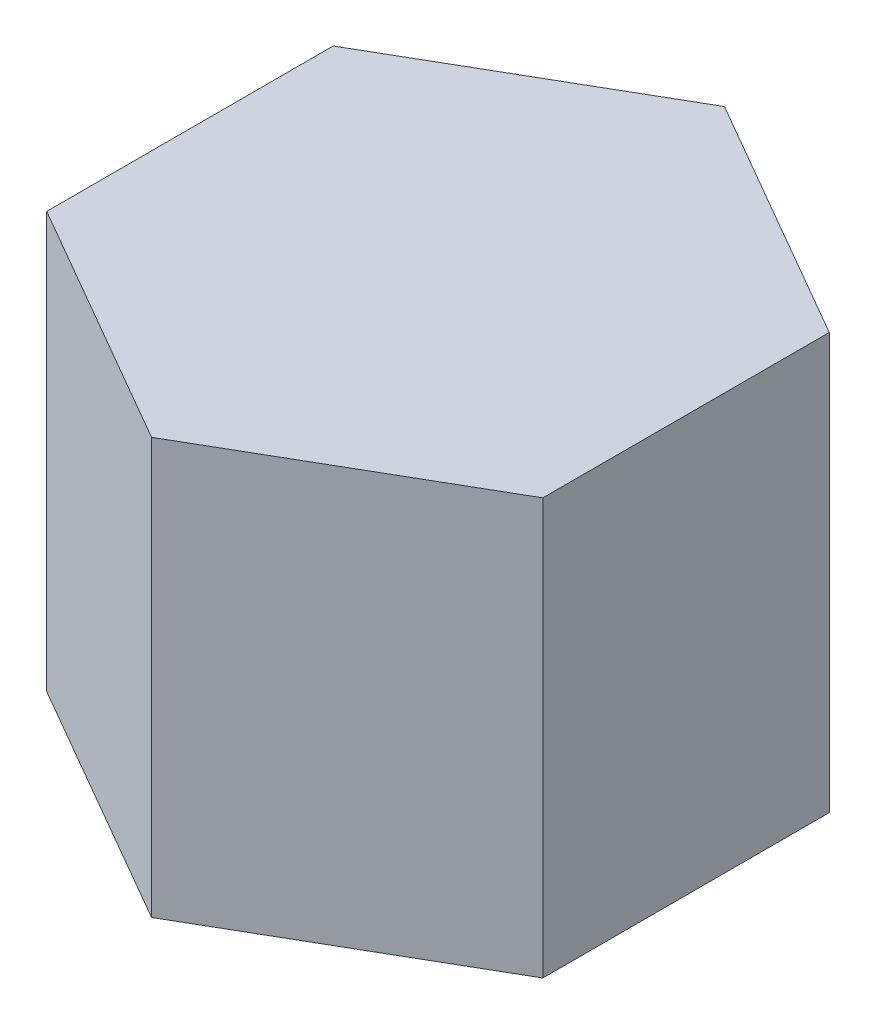
ISO-10303-21;
HEADER;
FILE_DESCRIPTION(('STEP AP214'),'2;1');
FILE_NAME('part.step','',(''),(''),'','','');
FILE_SCHEMA(('AUTOMOTIVE_DESIGN { 1 0 10303 214 1 1 1 1 }'));
ENDSEC;
DATA;
#1=APPLICATION_CONTEXT('core data for automotive mechanical design processes');
#2=APPLICATION_PROTOCOL_DEFINITION('international standard','automotive_design',2000,#1);
#3=PRODUCT_CONTEXT('',#1,'mechanical');
#4=PRODUCT('Part','Part','',(#3));
#5=PRODUCT_RELATED_PRODUCT_CATEGORY('part','',(#4));
#6=PRODUCT_DEFINITION_FORMATION('','',#4);
#7=PRODUCT_DEFINITION_CONTEXT('part definition',#1,'design');
#8=PRODUCT_DEFINITION('design','',#6,#7);
#9=PRODUCT_DEFINITION_SHAPE('','',#8);
#10=(LENGTH_UNIT() NAMED_UNIT(*) SI_UNIT(.MILLI.,.METRE.));
#11=(NAMED_UNIT(*) PLANE_ANGLE_UNIT() SI_UNIT($,.RADIAN.));
#12=(NAMED_UNIT(*) SI_UNIT($,.STERADIAN.) SOLID_ANGLE_UNIT());
#13=UNCERTAINTY_MEASURE_WITH_UNIT(LENGTH_MEASURE(1.E-05),#10,'distance_accuracy_value','');
#14=(GEOMETRIC_REPRESENTATION_CONTEXT(3) GLOBAL_UNCERTAINTY_ASSIGNED_CONTEXT((#13)) GLOBAL_UNIT_ASSIGNED_CONTEXT((#10,
#11,#12)) REPRESENTATION_CONTEXT('',''));
#15=CARTESIAN_POINT('',(0.,0.,0.));
#16=DIRECTION('',(0.,0.,1.));
#17=DIRECTION('',(1.,0.,0.));
#18=AXIS2_PLACEMENT_3D('',#15,#16,#17);
#19=CARTESIAN_POINT('',(207.142660308706,-148.537700895744,295.837098239417));
#20=DIRECTION('',(-0.499999999999909,0.,-0.866025403784491));
#21=DIRECTION('',(-0.866025403784491,0.,0.499999999999909));
#22=AXIS2_PLACEMENT_3D('',#19,#20,#21);
#23=PLANE('',#22);
#24=CARTESIAN_POINT('',(206.839551417381,-149.045793579175,296.012098239417));
#25=DIRECTION('',(0.866025403784491,0.,-0.499999999999909));
#26=VECTOR('',#25,1.);
#27=LINE('',#24,#26);
#28=CARTESIAN_POINT('',(206.839551417382,-149.045793579175,296.012098239417));
#29=VERTEX_POINT('',#28);
#30=CARTESIAN_POINT('',(207.142660308706,-149.045793579175,295.837098239417));
#31=VERTEX_POINT('',#30);
#32=EDGE_CURVE('E170',#29,#31,#27,.T.);
#33=ORIENTED_EDGE('',*,*,#32,.T.);
#34=CARTESIAN_POINT('',(207.142660308706,-148.537700895744,295.837098239417));
#35=DIRECTION('',(0.,-1.,0.));
#36=VECTOR('',#35,1.);
#37=LINE('',#34,#36);
#38=CARTESIAN_POINT('',(207.142660308706,-148.537700895744,295.837098239417));
#39=VERTEX_POINT('',#38);
#40=EDGE_CURVE('E35',#39,#31,#37,.T.);
#41=ORIENTED_EDGE('',*,*,#40,.F.);
#42=CARTESIAN_POINT('',(206.839551417381,-148.537700895744,296.012098239417));
#43=DIRECTION('',(0.866025403784491,0.,-0.499999999999909));
#44=VECTOR('',#43,1.);
#45=LINE('',#42,#44);
#46=CARTESIAN_POINT('',(206.839551417382,-148.537700895744,296.012098239417));
#47=VERTEX_POINT('',#46);
#48=EDGE_CURVE('E159',#47,#39,#45,.T.);
#49=ORIENTED_EDGE('',*,*,#48,.F.);
#50=CARTESIAN_POINT('',(206.839551417381,-148.537700895744,296.012098239417));
#51=DIRECTION('',(0.,-1.,0.));
#52=VECTOR('',#51,1.);
#53=LINE('',#50,#52);
#54=EDGE_CURVE('E10',#47,#29,#53,.T.);
#55=ORIENTED_EDGE('',*,*,#54,.T.);
#56=EDGE_LOOP('',(#33,#41,#49,#55));
#57=FACE_BOUND('',#56,.T.);
#58=ADVANCED_FACE('F16',(#57),#23,.F.);
#59=CARTESIAN_POINT('',(206.839551417382,-148.537700895744,296.012098239417));
#60=DIRECTION('',(0.500000000000062,0.,-0.866025403784403));
#61=DIRECTION('',(-0.866025403784403,0.,-0.500000000000062));
#62=AXIS2_PLACEMENT_3D('',#59,#60,#61);
#63=PLANE('',#62);
#64=CARTESIAN_POINT('',(206.536442526057,-149.045793579175,295.837098239417));
#65=DIRECTION('',(0.866025403784403,0.,0.500000000000062));
#66=VECTOR('',#65,1.);
#67=LINE('',#64,#66);
#68=CARTESIAN_POINT('',(206.536442526057,-149.045793579175,295.837098239417));
#69=VERTEX_POINT('',#68);
#70=EDGE_CURVE('E167',#69,#29,#67,.T.);
#71=ORIENTED_EDGE('',*,*,#70,.T.);
#72=ORIENTED_EDGE('',*,*,#54,.F.);
#73=CARTESIAN_POINT('',(206.536442526057,-148.537700895744,295.837098239417));
#74=DIRECTION('',(0.866025403784403,0.,0.500000000000062));
#75=VECTOR('',#74,1.);
#76=LINE('',#73,#75);
#77=CARTESIAN_POINT('',(206.536442526057,-148.537700895744,295.837098239417));
#78=VERTEX_POINT('',#77);
#79=EDGE_CURVE('E156',#78,#47,#76,.T.);
#80=ORIENTED_EDGE('',*,*,#79,.F.);
#81=CARTESIAN_POINT('',(206.536442526057,-148.537700895744,295.837098239417));
#82=DIRECTION('',(0.,-1.,0.));
#83=VECTOR('',#82,1.);
#84=LINE('',#81,#83);
#85=EDGE_CURVE('E27',#78,#69,#84,.T.);
#86=ORIENTED_EDGE('',*,*,#85,.T.);
#87=EDGE_LOOP('',(#71,#72,#80,#86));
#88=FACE_BOUND('',#87,.T.);
#89=ADVANCED_FACE('F189',(#88),#63,.F.);
#90=CARTESIAN_POINT('',(206.536442526057,-148.537700895744,290.831971220494));
#91=DIRECTION('',(1.,0.,0.));
#92=DIRECTION('',(0.,1.,0.));
#93=AXIS2_PLACEMENT_3D('',#90,#91,#92);
#94=PLANE('',#93);
#95=CARTESIAN_POINT('',(206.536442526057,-149.045793579175,295.487098239417));
#96=DIRECTION('',(0.,0.,1.));
#97=VECTOR('',#96,1.);
#98=LINE('',#95,#97);
#99=CARTESIAN_POINT('',(206.536442526057,-149.045793579175,295.487098239417));
#100=VERTEX_POINT('',#99);
#101=EDGE_CURVE('E163',#100,#69,#98,.T.);
#102=ORIENTED_EDGE('',*,*,#101,.T.);
#103=ORIENTED_EDGE('',*,*,#85,.F.);
#104=CARTESIAN_POINT('',(206.536442526057,-148.537700895744,295.487098239417));
#105=DIRECTION('',(0.,0.,1.));
#106=VECTOR('',#105,1.);
#107=LINE('',#104,#106);
#108=CARTESIAN_POINT('',(206.536442526057,-148.537700895744,295.487098239417));
#109=VERTEX_POINT('',#108);
#110=EDGE_CURVE('E106',#109,#78,#107,.T.);
#111=ORIENTED_EDGE('',*,*,#110,.F.);
#112=CARTESIAN_POINT('',(206.536442526057,-148.537700895744,295.487098239417));
#113=DIRECTION('',(0.,-1.,0.));
#114=VECTOR('',#113,1.);
#115=LINE('',#112,#114);
#116=EDGE_CURVE('E94',#109,#100,#115,.T.);
#117=ORIENTED_EDGE('',*,*,#116,.T.);
#118=EDGE_LOOP('',(#102,#103,#111,#117));
#119=FACE_BOUND('',#118,.T.);
#120=ADVANCED_FACE('F198',(#119),#94,.F.);
#121=CARTESIAN_POINT('',(206.536442526057,-148.537700895744,295.487098239417));
#122=DIRECTION('',(0.499999999999978,0.,0.866025403784452));
#123=DIRECTION('',(0.866025403784452,0.,-0.499999999999978));
#124=AXIS2_PLACEMENT_3D('',#121,#122,#123);
#125=PLANE('',#124);
#126=CARTESIAN_POINT('',(206.839551417382,-149.045793579175,295.312098239417));
#127=DIRECTION('',(-0.866025403784452,0.,0.499999999999978));
#128=VECTOR('',#127,1.);
#129=LINE('',#126,#128);
#130=CARTESIAN_POINT('',(206.839551417382,-149.045793579175,295.312098239417));
#131=VERTEX_POINT('',#130);
#132=EDGE_CURVE('E162',#131,#100,#129,.T.);
#133=ORIENTED_EDGE('',*,*,#132,.T.);
#134=ORIENTED_EDGE('',*,*,#116,.F.);
#135=CARTESIAN_POINT('',(206.839551417382,-148.537700895744,295.312098239417));
#136=DIRECTION('',(-0.866025403784452,0.,0.499999999999978));
#137=VECTOR('',#136,1.);
#138=LINE('',#135,#137);
#139=CARTESIAN_POINT('',(206.839551417382,-148.537700895744,295.312098239417));
#140=VERTEX_POINT('',#139);
#141=EDGE_CURVE('E98',#140,#109,#138,.T.);
#142=ORIENTED_EDGE('',*,*,#141,.F.);
#143=CARTESIAN_POINT('',(206.839551417382,-148.537700895744,295.312098239417));
#144=DIRECTION('',(0.,-1.,0.));
#145=VECTOR('',#144,1.);
#146=LINE('',#143,#145);
#147=EDGE_CURVE('E79',#140,#131,#146,.T.);
#148=ORIENTED_EDGE('',*,*,#147,.T.);
#149=EDGE_LOOP('',(#133,#134,#142,#148));
#150=FACE_BOUND('',#149,.T.);
#151=ADVANCED_FACE('F100',(#150),#125,.F.);
#152=CARTESIAN_POINT('',(206.839551417382,-148.537700895744,295.312098239417));
#153=DIRECTION('',(-0.500000000000012,0.,0.866025403784432));
#154=DIRECTION('',(0.866025403784432,0.,0.500000000000012));
#155=AXIS2_PLACEMENT_3D('',#152,#153,#154);
#156=PLANE('',#155);
#157=CARTESIAN_POINT('',(207.142660308706,-149.045793579175,295.487098239417));
#158=DIRECTION('',(-0.866025403784432,0.,-0.500000000000012));
#159=VECTOR('',#158,1.);
#160=LINE('',#157,#159);
#161=CARTESIAN_POINT('',(207.142660308706,-149.045793579175,295.487098239417));
#162=VERTEX_POINT('',#161);
#163=EDGE_CURVE('E88',#162,#131,#160,.T.);
#164=ORIENTED_EDGE('',*,*,#163,.T.);
#165=ORIENTED_EDGE('',*,*,#147,.F.);
#166=CARTESIAN_POINT('',(207.142660308706,-148.537700895744,295.487098239417));
#167=DIRECTION('',(-0.866025403784432,0.,-0.500000000000012));
#168=VECTOR('',#167,1.);
#169=LINE('',#166,#168);
#170=CARTESIAN_POINT('',(207.142660308706,-148.537700895744,295.487098239417));
#171=VERTEX_POINT('',#170);
#172=EDGE_CURVE('E84',#171,#140,#169,.T.);
#173=ORIENTED_EDGE('',*,*,#172,.F.);
#174=CARTESIAN_POINT('',(207.142660308706,-148.537700895744,295.487098239417));
#175=DIRECTION('',(0.,-1.,0.));
#176=VECTOR('',#175,1.);
#177=LINE('',#174,#176);
#178=EDGE_CURVE('E58',#171,#162,#177,.T.);
#179=ORIENTED_EDGE('',*,*,#178,.T.);
#180=EDGE_LOOP('',(#164,#165,#173,#179));
#181=FACE_BOUND('',#180,.T.);
#182=ADVANCED_FACE('F82',(#181),#156,.F.);
#183=CARTESIAN_POINT('',(207.142660308706,-148.537700895744,290.831971220494));
#184=DIRECTION('',(-1.,0.,0.));
#185=DIRECTION('',(0.,-1.,0.));
#186=AXIS2_PLACEMENT_3D('',#183,#184,#185);
#187=PLANE('',#186);
#188=CARTESIAN_POINT('',(207.142660308706,-149.045793579175,295.837098239417));
#189=DIRECTION('',(0.,0.,-1.));
#190=VECTOR('',#189,1.);
#191=LINE('',#188,#190);
#192=EDGE_CURVE('E160',#31,#162,#191,.T.);
#193=ORIENTED_EDGE('',*,*,#192,.T.);
#194=ORIENTED_EDGE('',*,*,#178,.F.);
#195=CARTESIAN_POINT('',(207.142660308706,-148.537700895744,295.837098239417));
#196=DIRECTION('',(0.,0.,-1.));
#197=VECTOR('',#196,1.);
#198=LINE('',#195,#197);
#199=EDGE_CURVE('E112',#39,#171,#198,.T.);
#200=ORIENTED_EDGE('',*,*,#199,.F.);
#201=ORIENTED_EDGE('',*,*,#40,.T.);
#202=EDGE_LOOP('',(#193,#194,#200,#201));
#203=FACE_BOUND('',#202,.T.);
#204=ADVANCED_FACE('F131',(#203),#187,.F.);
#205=CARTESIAN_POINT('',(206.339551417382,-148.537700895744,290.831971220494));
#206=DIRECTION('',(0.,-1.,0.));
#207=DIRECTION('',(1.,0.,0.));
#208=AXIS2_PLACEMENT_3D('',#205,#206,#207);
#209=PLANE('',#208);
#210=ORIENTED_EDGE('',*,*,#48,.T.);
#211=ORIENTED_EDGE('',*,*,#199,.T.);
#212=ORIENTED_EDGE('',*,*,#172,.T.);
#213=ORIENTED_EDGE('',*,*,#141,.T.);
#214=ORIENTED_EDGE('',*,*,#110,.T.);
#215=ORIENTED_EDGE('',*,*,#79,.T.);
#216=EDGE_LOOP('',(#210,#211,#212,#213,#214,#215));
#217=FACE_BOUND('',#216,.T.);
#218=ADVANCED_FACE('F111',(#217),#209,.F.);
#219=CARTESIAN_POINT('',(206.339551417382,-149.045793579175,290.831971220494));
#220=DIRECTION('',(0.,-1.,0.));
#221=DIRECTION('',(1.,0.,0.));
#222=AXIS2_PLACEMENT_3D('',#219,#220,#221);
#223=PLANE('',#222);
#224=ORIENTED_EDGE('',*,*,#32,.F.);
#225=ORIENTED_EDGE('',*,*,#70,.F.);
#226=ORIENTED_EDGE('',*,*,#101,.F.);
#227=ORIENTED_EDGE('',*,*,#132,.F.);
#228=ORIENTED_EDGE('',*,*,#163,.F.);
#229=ORIENTED_EDGE('',*,*,#192,.F.);
#230=EDGE_LOOP('',(#224,#225,#226,#227,#228,#229));
#231=FACE_BOUND('',#230,.T.);
#232=ADVANCED_FACE('F130',(#231),#223,.T.);
#233=CLOSED_SHELL('',(#58,#89,#120,#151,#182,#204,#218,#232));
#234=MANIFOLD_SOLID_BREP('B1',#233);
#235=ADVANCED_BREP_SHAPE_REPRESENTATION('',(#18,#234),#14);
#236=SHAPE_DEFINITION_REPRESENTATION(#9,#235);
ENDSEC;
END-ISO-10303-21;
